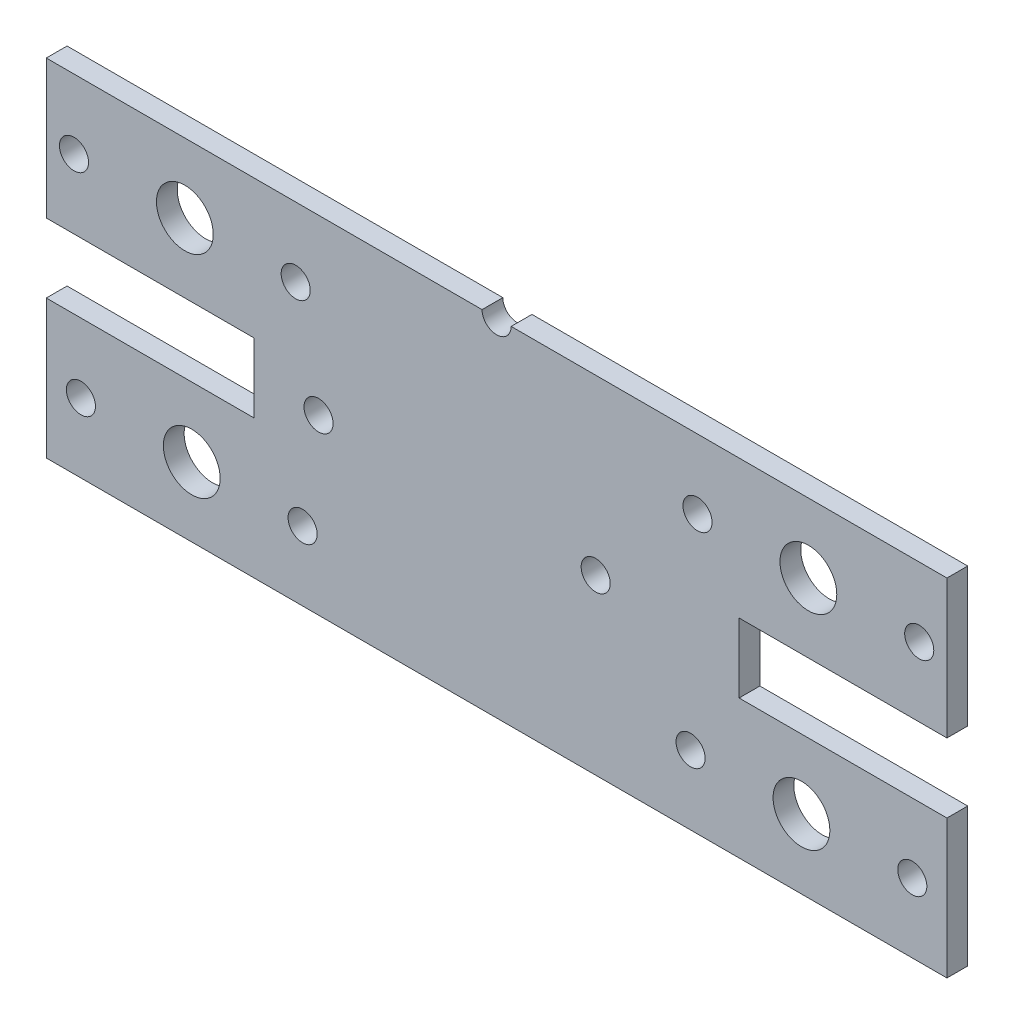
ISO-10303-21;
HEADER;
FILE_DESCRIPTION(('STEP AP214'),'2;1');
FILE_NAME('part.step','',(''),(''),'','','');
FILE_SCHEMA(('AUTOMOTIVE_DESIGN { 1 0 10303 214 1 1 1 1 }'));
ENDSEC;
DATA;
#1=APPLICATION_CONTEXT('core data for automotive mechanical design processes');
#2=APPLICATION_PROTOCOL_DEFINITION('international standard','automotive_design',2000,#1);
#3=PRODUCT_CONTEXT('',#1,'mechanical');
#4=PRODUCT('Part','Part','',(#3));
#5=PRODUCT_RELATED_PRODUCT_CATEGORY('part','',(#4));
#6=PRODUCT_DEFINITION_FORMATION('','',#4);
#7=PRODUCT_DEFINITION_CONTEXT('part definition',#1,'design');
#8=PRODUCT_DEFINITION('design','',#6,#7);
#9=PRODUCT_DEFINITION_SHAPE('','',#8);
#10=(LENGTH_UNIT() NAMED_UNIT(*) SI_UNIT(.MILLI.,.METRE.));
#11=(NAMED_UNIT(*) PLANE_ANGLE_UNIT() SI_UNIT($,.RADIAN.));
#12=(NAMED_UNIT(*) SI_UNIT($,.STERADIAN.) SOLID_ANGLE_UNIT());
#13=UNCERTAINTY_MEASURE_WITH_UNIT(LENGTH_MEASURE(1.E-05),#10,'distance_accuracy_value','');
#14=(GEOMETRIC_REPRESENTATION_CONTEXT(3) GLOBAL_UNCERTAINTY_ASSIGNED_CONTEXT((#13)) GLOBAL_UNIT_ASSIGNED_CONTEXT((#10,
#11,#12)) REPRESENTATION_CONTEXT('',''));
#15=CARTESIAN_POINT('',(0.,0.,0.));
#16=DIRECTION('',(0.,0.,1.));
#17=DIRECTION('',(1.,0.,0.));
#18=AXIS2_PLACEMENT_3D('',#15,#16,#17);
#19=CARTESIAN_POINT('',(0.,0.,3.));
#20=DIRECTION('',(1.,0.,0.));
#21=DIRECTION('',(0.,0.,-1.));
#22=AXIS2_PLACEMENT_3D('',#19,#20,#21);
#23=PLANE('',#22);
#24=DIRECTION('',(0.,-1.,0.));
#25=VECTOR('',#24,1.);
#26=CARTESIAN_POINT('',(0.,0.,3.));
#27=LINE('',#26,#25);
#28=CARTESIAN_POINT('',(0.,20.,3.));
#29=VERTEX_POINT('',#28);
#30=CARTESIAN_POINT('',(0.,0.,3.));
#31=VERTEX_POINT('',#30);
#32=EDGE_CURVE('E175',#29,#31,#27,.T.);
#33=ORIENTED_EDGE('',*,*,#32,.F.);
#34=DIRECTION('',(0.,0.,-1.));
#35=VECTOR('',#34,1.);
#36=CARTESIAN_POINT('',(0.,20.,3.001));
#37=LINE('',#36,#35);
#38=CARTESIAN_POINT('',(0.,20.,0.));
#39=VERTEX_POINT('',#38);
#40=EDGE_CURVE('E342',#29,#39,#37,.T.);
#41=ORIENTED_EDGE('',*,*,#40,.T.);
#42=DIRECTION('',(0.,-1.,0.));
#43=VECTOR('',#42,1.);
#44=CARTESIAN_POINT('',(0.,0.,0.));
#45=LINE('',#44,#43);
#46=CARTESIAN_POINT('',(0.,0.,0.));
#47=VERTEX_POINT('',#46);
#48=EDGE_CURVE('E159',#39,#47,#45,.T.);
#49=ORIENTED_EDGE('',*,*,#48,.T.);
#50=DIRECTION('',(0.,0.,-1.));
#51=VECTOR('',#50,1.);
#52=CARTESIAN_POINT('',(0.,0.,3.));
#53=LINE('',#52,#51);
#54=EDGE_CURVE('E11',#31,#47,#53,.T.);
#55=ORIENTED_EDGE('',*,*,#54,.F.);
#56=EDGE_LOOP('',(#33,#41,#49,#55));
#57=FACE_BOUND('',#56,.T.);
#58=ADVANCED_FACE('F33',(#57),#23,.F.);
#59=CARTESIAN_POINT('',(130.,0.,3.));
#60=DIRECTION('',(-1.,0.,0.));
#61=DIRECTION('',(0.,0.,1.));
#62=AXIS2_PLACEMENT_3D('',#59,#60,#61);
#63=PLANE('',#62);
#64=DIRECTION('',(0.,1.,0.));
#65=VECTOR('',#64,1.);
#66=CARTESIAN_POINT('',(130.,0.,3.));
#67=LINE('',#66,#65);
#68=CARTESIAN_POINT('',(130.,30.,3.));
#69=VERTEX_POINT('',#68);
#70=CARTESIAN_POINT('',(130.,50.,3.));
#71=VERTEX_POINT('',#70);
#72=EDGE_CURVE('E314',#69,#71,#67,.T.);
#73=ORIENTED_EDGE('',*,*,#72,.F.);
#74=DIRECTION('',(0.,0.,-1.));
#75=VECTOR('',#74,1.);
#76=CARTESIAN_POINT('',(130.,30.,3.001));
#77=LINE('',#76,#75);
#78=CARTESIAN_POINT('',(130.,30.,0.));
#79=VERTEX_POINT('',#78);
#80=EDGE_CURVE('E209',#69,#79,#77,.T.);
#81=ORIENTED_EDGE('',*,*,#80,.T.);
#82=DIRECTION('',(0.,1.,0.));
#83=VECTOR('',#82,1.);
#84=CARTESIAN_POINT('',(130.,0.,0.));
#85=LINE('',#84,#83);
#86=CARTESIAN_POINT('',(130.,50.,0.));
#87=VERTEX_POINT('',#86);
#88=EDGE_CURVE('E161',#79,#87,#85,.T.);
#89=ORIENTED_EDGE('',*,*,#88,.T.);
#90=DIRECTION('',(0.,0.,-1.));
#91=VECTOR('',#90,1.);
#92=CARTESIAN_POINT('',(130.,50.,3.));
#93=LINE('',#92,#91);
#94=EDGE_CURVE('E177',#71,#87,#93,.T.);
#95=ORIENTED_EDGE('',*,*,#94,.F.);
#96=EDGE_LOOP('',(#73,#81,#89,#95));
#97=FACE_BOUND('',#96,.T.);
#98=ADVANCED_FACE('F328',(#97),#63,.F.);
#99=CARTESIAN_POINT('',(0.,50.,3.));
#100=DIRECTION('',(0.,-1.,0.));
#101=DIRECTION('',(0.,0.,-1.));
#102=AXIS2_PLACEMENT_3D('',#99,#100,#101);
#103=PLANE('',#102);
#104=DIRECTION('',(-1.,0.,0.));
#105=VECTOR('',#104,1.);
#106=CARTESIAN_POINT('',(0.,50.,3.));
#107=LINE('',#106,#105);
#108=CARTESIAN_POINT('',(62.9,50.,3.));
#109=VERTEX_POINT('',#108);
#110=CARTESIAN_POINT('',(0.,50.,3.));
#111=VERTEX_POINT('',#110);
#112=EDGE_CURVE('E315',#109,#111,#107,.T.);
#113=ORIENTED_EDGE('',*,*,#112,.F.);
#114=DIRECTION('',(0.,0.,-1.));
#115=VECTOR('',#114,1.);
#116=CARTESIAN_POINT('',(62.9,50.,3.001));
#117=LINE('',#116,#115);
#118=CARTESIAN_POINT('',(62.9,50.,0.));
#119=VERTEX_POINT('',#118);
#120=EDGE_CURVE('E223',#109,#119,#117,.T.);
#121=ORIENTED_EDGE('',*,*,#120,.T.);
#122=DIRECTION('',(-1.,0.,0.));
#123=VECTOR('',#122,1.);
#124=CARTESIAN_POINT('',(0.,50.,0.));
#125=LINE('',#124,#123);
#126=CARTESIAN_POINT('',(0.,50.,0.));
#127=VERTEX_POINT('',#126);
#128=EDGE_CURVE('E171',#119,#127,#125,.T.);
#129=ORIENTED_EDGE('',*,*,#128,.T.);
#130=DIRECTION('',(0.,0.,-1.));
#131=VECTOR('',#130,1.);
#132=CARTESIAN_POINT('',(0.,50.,3.));
#133=LINE('',#132,#131);
#134=EDGE_CURVE('E157',#111,#127,#133,.T.);
#135=ORIENTED_EDGE('',*,*,#134,.F.);
#136=EDGE_LOOP('',(#113,#121,#129,#135));
#137=FACE_BOUND('',#136,.T.);
#138=ADVANCED_FACE('F339',(#137),#103,.F.);
#139=CARTESIAN_POINT('',(0.,0.,3.));
#140=DIRECTION('',(0.,0.,-1.));
#141=DIRECTION('',(-1.,0.,0.));
#142=AXIS2_PLACEMENT_3D('',#139,#140,#141);
#143=PLANE('',#142);
#144=DIRECTION('',(0.,1.,0.));
#145=VECTOR('',#144,1.);
#146=CARTESIAN_POINT('',(30.,20.,3.));
#147=LINE('',#146,#145);
#148=CARTESIAN_POINT('',(30.,20.,3.));
#149=VERTEX_POINT('',#148);
#150=CARTESIAN_POINT('',(30.,30.,3.));
#151=VERTEX_POINT('',#150);
#152=EDGE_CURVE('E218',#149,#151,#147,.T.);
#153=ORIENTED_EDGE('',*,*,#152,.F.);
#154=DIRECTION('',(1.,0.,0.));
#155=VECTOR('',#154,1.);
#156=CARTESIAN_POINT('',(0.,20.,3.));
#157=LINE('',#156,#155);
#158=EDGE_CURVE('E153',#29,#149,#157,.T.);
#159=ORIENTED_EDGE('',*,*,#158,.F.);
#160=ORIENTED_EDGE('',*,*,#32,.T.);
#161=DIRECTION('',(1.,0.,0.));
#162=VECTOR('',#161,1.);
#163=CARTESIAN_POINT('',(0.,0.,3.));
#164=LINE('',#163,#162);
#165=CARTESIAN_POINT('',(130.,0.,3.));
#166=VERTEX_POINT('',#165);
#167=EDGE_CURVE('E313',#31,#166,#164,.T.);
#168=ORIENTED_EDGE('',*,*,#167,.T.);
#169=CARTESIAN_POINT('',(130.,20.,3.));
#170=VERTEX_POINT('',#169);
#171=EDGE_CURVE('E186',#166,#170,#67,.T.);
#172=ORIENTED_EDGE('',*,*,#171,.T.);
#173=DIRECTION('',(1.,0.,0.));
#174=VECTOR('',#173,1.);
#175=CARTESIAN_POINT('',(130.,20.,3.));
#176=LINE('',#175,#174);
#177=CARTESIAN_POINT('',(100.,20.,3.));
#178=VERTEX_POINT('',#177);
#179=EDGE_CURVE('E56',#178,#170,#176,.T.);
#180=ORIENTED_EDGE('',*,*,#179,.F.);
#181=DIRECTION('',(0.,-1.,0.));
#182=VECTOR('',#181,1.);
#183=CARTESIAN_POINT('',(100.,20.,3.));
#184=LINE('',#183,#182);
#185=CARTESIAN_POINT('',(100.,30.,3.));
#186=VERTEX_POINT('',#185);
#187=EDGE_CURVE('E203',#186,#178,#184,.T.);
#188=ORIENTED_EDGE('',*,*,#187,.F.);
#189=DIRECTION('',(-1.,0.,0.));
#190=VECTOR('',#189,1.);
#191=CARTESIAN_POINT('',(130.,30.,3.));
#192=LINE('',#191,#190);
#193=EDGE_CURVE('E198',#69,#186,#192,.T.);
#194=ORIENTED_EDGE('',*,*,#193,.F.);
#195=ORIENTED_EDGE('',*,*,#72,.T.);
#196=CARTESIAN_POINT('',(67.1,50.,3.));
#197=VERTEX_POINT('',#196);
#198=EDGE_CURVE('E165',#71,#197,#107,.T.);
#199=ORIENTED_EDGE('',*,*,#198,.T.);
#200=CARTESIAN_POINT('',(65.,50.,3.));
#201=DIRECTION('',(0.,0.,-1.));
#202=DIRECTION('',(-1.,0.,0.));
#203=AXIS2_PLACEMENT_3D('',#200,#201,#202);
#204=CIRCLE('',#203,2.1);
#205=EDGE_CURVE('E219',#109,#197,#204,.F.);
#206=ORIENTED_EDGE('',*,*,#205,.F.);
#207=ORIENTED_EDGE('',*,*,#112,.T.);
#208=CARTESIAN_POINT('',(0.,30.,3.));
#209=VERTEX_POINT('',#208);
#210=EDGE_CURVE('E311',#111,#209,#27,.T.);
#211=ORIENTED_EDGE('',*,*,#210,.T.);
#212=DIRECTION('',(-1.,0.,0.));
#213=VECTOR('',#212,1.);
#214=CARTESIAN_POINT('',(0.,30.,3.));
#215=LINE('',#214,#213);
#216=EDGE_CURVE('E48',#151,#209,#215,.T.);
#217=ORIENTED_EDGE('',*,*,#216,.F.);
#218=EDGE_LOOP('',(#153,#159,#160,#168,#172,#180,#188,#194,#195,#199,#206,#207,#211,#217));
#219=FACE_BOUND('',#218,.T.);
#220=CARTESIAN_POINT('',(39.3,25.,3.));
#221=DIRECTION('',(0.,0.,1.));
#222=DIRECTION('',(1.,0.,0.));
#223=AXIS2_PLACEMENT_3D('',#220,#221,#222);
#224=CIRCLE('',#223,2.1);
#225=CARTESIAN_POINT('',(41.4,25.,3.));
#226=VERTEX_POINT('',#225);
#227=EDGE_CURVE('E163',#226,#226,#224,.T.);
#228=ORIENTED_EDGE('',*,*,#227,.F.);
#229=EDGE_LOOP('',(#228));
#230=FACE_BOUND('',#229,.T.);
#231=CARTESIAN_POINT('',(79.3,25.,3.));
#232=DIRECTION('',(0.,0.,1.));
#233=DIRECTION('',(1.,0.,0.));
#234=AXIS2_PLACEMENT_3D('',#231,#232,#233);
#235=CIRCLE('',#234,2.1);
#236=CARTESIAN_POINT('',(81.4,25.,3.));
#237=VERTEX_POINT('',#236);
#238=EDGE_CURVE('E301',#237,#237,#235,.T.);
#239=ORIENTED_EDGE('',*,*,#238,.F.);
#240=EDGE_LOOP('',(#239));
#241=FACE_BOUND('',#240,.T.);
#242=CARTESIAN_POINT('',(4.,40.,3.));
#243=DIRECTION('',(0.,0.,1.));
#244=DIRECTION('',(1.,0.,0.));
#245=AXIS2_PLACEMENT_3D('',#242,#243,#244);
#246=CIRCLE('',#245,2.1);
#247=CARTESIAN_POINT('',(6.1,40.,3.));
#248=VERTEX_POINT('',#247);
#249=EDGE_CURVE('E295',#248,#248,#246,.T.);
#250=ORIENTED_EDGE('',*,*,#249,.F.);
#251=EDGE_LOOP('',(#250));
#252=FACE_BOUND('',#251,.T.);
#253=CARTESIAN_POINT('',(20.,40.,3.));
#254=DIRECTION('',(0.,0.,1.));
#255=DIRECTION('',(1.,0.,0.));
#256=AXIS2_PLACEMENT_3D('',#253,#254,#255);
#257=CIRCLE('',#256,4.10000000000001);
#258=CARTESIAN_POINT('',(24.1,40.,3.));
#259=VERTEX_POINT('',#258);
#260=EDGE_CURVE('E289',#259,#259,#257,.T.);
#261=ORIENTED_EDGE('',*,*,#260,.F.);
#262=EDGE_LOOP('',(#261));
#263=FACE_BOUND('',#262,.T.);
#264=CARTESIAN_POINT('',(36.,40.,3.));
#265=DIRECTION('',(0.,0.,1.));
#266=DIRECTION('',(1.,0.,0.));
#267=AXIS2_PLACEMENT_3D('',#264,#265,#266);
#268=CIRCLE('',#267,2.1);
#269=CARTESIAN_POINT('',(38.1,40.,3.));
#270=VERTEX_POINT('',#269);
#271=EDGE_CURVE('E283',#270,#270,#268,.T.);
#272=ORIENTED_EDGE('',*,*,#271,.F.);
#273=EDGE_LOOP('',(#272));
#274=FACE_BOUND('',#273,.T.);
#275=CARTESIAN_POINT('',(94.,40.,3.));
#276=DIRECTION('',(0.,0.,1.));
#277=DIRECTION('',(1.,0.,0.));
#278=AXIS2_PLACEMENT_3D('',#275,#276,#277);
#279=CIRCLE('',#278,2.1);
#280=CARTESIAN_POINT('',(96.1,40.,3.));
#281=VERTEX_POINT('',#280);
#282=EDGE_CURVE('E277',#281,#281,#279,.T.);
#283=ORIENTED_EDGE('',*,*,#282,.F.);
#284=EDGE_LOOP('',(#283));
#285=FACE_BOUND('',#284,.T.);
#286=CARTESIAN_POINT('',(110.,40.,3.));
#287=DIRECTION('',(0.,0.,1.));
#288=DIRECTION('',(1.,0.,0.));
#289=AXIS2_PLACEMENT_3D('',#286,#287,#288);
#290=CIRCLE('',#289,4.1);
#291=CARTESIAN_POINT('',(114.1,40.,3.));
#292=VERTEX_POINT('',#291);
#293=EDGE_CURVE('E271',#292,#292,#290,.T.);
#294=ORIENTED_EDGE('',*,*,#293,.F.);
#295=EDGE_LOOP('',(#294));
#296=FACE_BOUND('',#295,.T.);
#297=CARTESIAN_POINT('',(126.,40.,3.));
#298=DIRECTION('',(0.,0.,1.));
#299=DIRECTION('',(1.,0.,0.));
#300=AXIS2_PLACEMENT_3D('',#297,#298,#299);
#301=CIRCLE('',#300,2.09999999999999);
#302=CARTESIAN_POINT('',(128.1,40.,3.));
#303=VERTEX_POINT('',#302);
#304=EDGE_CURVE('E265',#303,#303,#301,.T.);
#305=ORIENTED_EDGE('',*,*,#304,.F.);
#306=EDGE_LOOP('',(#305));
#307=FACE_BOUND('',#306,.T.);
#308=CARTESIAN_POINT('',(5.,9.99999999999998,3.));
#309=DIRECTION('',(0.,0.,1.));
#310=DIRECTION('',(1.,0.,0.));
#311=AXIS2_PLACEMENT_3D('',#308,#309,#310);
#312=CIRCLE('',#311,2.1);
#313=CARTESIAN_POINT('',(7.1,9.99999999999998,3.));
#314=VERTEX_POINT('',#313);
#315=EDGE_CURVE('E259',#314,#314,#312,.T.);
#316=ORIENTED_EDGE('',*,*,#315,.F.);
#317=EDGE_LOOP('',(#316));
#318=FACE_BOUND('',#317,.T.);
#319=CARTESIAN_POINT('',(21.,9.99999999999998,3.));
#320=DIRECTION('',(0.,0.,1.));
#321=DIRECTION('',(1.,0.,0.));
#322=AXIS2_PLACEMENT_3D('',#319,#320,#321);
#323=CIRCLE('',#322,4.1);
#324=CARTESIAN_POINT('',(25.1,9.99999999999998,3.));
#325=VERTEX_POINT('',#324);
#326=EDGE_CURVE('E253',#325,#325,#323,.T.);
#327=ORIENTED_EDGE('',*,*,#326,.F.);
#328=EDGE_LOOP('',(#327));
#329=FACE_BOUND('',#328,.T.);
#330=CARTESIAN_POINT('',(37.,9.99999999999999,3.));
#331=DIRECTION('',(0.,0.,1.));
#332=DIRECTION('',(1.,0.,0.));
#333=AXIS2_PLACEMENT_3D('',#330,#331,#332);
#334=CIRCLE('',#333,2.1);
#335=CARTESIAN_POINT('',(39.1,9.99999999999999,3.));
#336=VERTEX_POINT('',#335);
#337=EDGE_CURVE('E247',#336,#336,#334,.T.);
#338=ORIENTED_EDGE('',*,*,#337,.F.);
#339=EDGE_LOOP('',(#338));
#340=FACE_BOUND('',#339,.T.);
#341=CARTESIAN_POINT('',(93.,10.,3.));
#342=DIRECTION('',(0.,0.,1.));
#343=DIRECTION('',(1.,0.,0.));
#344=AXIS2_PLACEMENT_3D('',#341,#342,#343);
#345=CIRCLE('',#344,2.1);
#346=CARTESIAN_POINT('',(95.1,10.,3.));
#347=VERTEX_POINT('',#346);
#348=EDGE_CURVE('E241',#347,#347,#345,.T.);
#349=ORIENTED_EDGE('',*,*,#348,.F.);
#350=EDGE_LOOP('',(#349));
#351=FACE_BOUND('',#350,.T.);
#352=CARTESIAN_POINT('',(109.,10.,3.));
#353=DIRECTION('',(0.,0.,1.));
#354=DIRECTION('',(1.,0.,0.));
#355=AXIS2_PLACEMENT_3D('',#352,#353,#354);
#356=CIRCLE('',#355,4.1);
#357=CARTESIAN_POINT('',(113.1,10.,3.));
#358=VERTEX_POINT('',#357);
#359=EDGE_CURVE('E235',#358,#358,#356,.T.);
#360=ORIENTED_EDGE('',*,*,#359,.F.);
#361=EDGE_LOOP('',(#360));
#362=FACE_BOUND('',#361,.T.);
#363=CARTESIAN_POINT('',(125.,10.,3.));
#364=DIRECTION('',(0.,0.,1.));
#365=DIRECTION('',(1.,0.,0.));
#366=AXIS2_PLACEMENT_3D('',#363,#364,#365);
#367=CIRCLE('',#366,2.09999999999999);
#368=CARTESIAN_POINT('',(127.1,10.,3.));
#369=VERTEX_POINT('',#368);
#370=EDGE_CURVE('E228',#369,#369,#367,.T.);
#371=ORIENTED_EDGE('',*,*,#370,.F.);
#372=EDGE_LOOP('',(#371));
#373=FACE_BOUND('',#372,.T.);
#374=ADVANCED_FACE('F322',(#219,#230,#241,#252,#263,#274,#285,#296,#307,#318,#329,#340,#351,
#362,#373),#143,.F.);
#375=CARTESIAN_POINT('',(0.,0.,0.));
#376=DIRECTION('',(0.,0.,-1.));
#377=DIRECTION('',(-1.,0.,0.));
#378=AXIS2_PLACEMENT_3D('',#375,#376,#377);
#379=PLANE('',#378);
#380=DIRECTION('',(-1.,0.,0.));
#381=VECTOR('',#380,1.);
#382=CARTESIAN_POINT('',(0.,20.,0.));
#383=LINE('',#382,#381);
#384=CARTESIAN_POINT('',(30.,20.,0.));
#385=VERTEX_POINT('',#384);
#386=EDGE_CURVE('E142',#385,#39,#383,.T.);
#387=ORIENTED_EDGE('',*,*,#386,.F.);
#388=DIRECTION('',(0.,-1.,0.));
#389=VECTOR('',#388,1.);
#390=CARTESIAN_POINT('',(30.,20.,0.));
#391=LINE('',#390,#389);
#392=CARTESIAN_POINT('',(30.,30.,0.));
#393=VERTEX_POINT('',#392);
#394=EDGE_CURVE('E152',#393,#385,#391,.T.);
#395=ORIENTED_EDGE('',*,*,#394,.F.);
#396=DIRECTION('',(1.,0.,0.));
#397=VECTOR('',#396,1.);
#398=CARTESIAN_POINT('',(0.,30.,0.));
#399=LINE('',#398,#397);
#400=CARTESIAN_POINT('',(0.,30.,0.));
#401=VERTEX_POINT('',#400);
#402=EDGE_CURVE('E135',#401,#393,#399,.T.);
#403=ORIENTED_EDGE('',*,*,#402,.F.);
#404=EDGE_CURVE('E150',#127,#401,#45,.T.);
#405=ORIENTED_EDGE('',*,*,#404,.F.);
#406=ORIENTED_EDGE('',*,*,#128,.F.);
#407=CARTESIAN_POINT('',(65.,50.,0.));
#408=DIRECTION('',(0.,0.,-1.));
#409=DIRECTION('',(-1.,0.,0.));
#410=AXIS2_PLACEMENT_3D('',#407,#408,#409);
#411=CIRCLE('',#410,2.1);
#412=CARTESIAN_POINT('',(67.1,50.,0.));
#413=VERTEX_POINT('',#412);
#414=EDGE_CURVE('E221',#413,#119,#411,.T.);
#415=ORIENTED_EDGE('',*,*,#414,.F.);
#416=EDGE_CURVE('E172',#87,#413,#125,.T.);
#417=ORIENTED_EDGE('',*,*,#416,.F.);
#418=ORIENTED_EDGE('',*,*,#88,.F.);
#419=DIRECTION('',(1.,0.,0.));
#420=VECTOR('',#419,1.);
#421=CARTESIAN_POINT('',(130.,30.,0.));
#422=LINE('',#421,#420);
#423=CARTESIAN_POINT('',(100.,30.,0.));
#424=VERTEX_POINT('',#423);
#425=EDGE_CURVE('E200',#424,#79,#422,.T.);
#426=ORIENTED_EDGE('',*,*,#425,.F.);
#427=DIRECTION('',(0.,1.,0.));
#428=VECTOR('',#427,1.);
#429=CARTESIAN_POINT('',(100.,20.,0.));
#430=LINE('',#429,#428);
#431=CARTESIAN_POINT('',(100.,20.,0.));
#432=VERTEX_POINT('',#431);
#433=EDGE_CURVE('E197',#432,#424,#430,.T.);
#434=ORIENTED_EDGE('',*,*,#433,.F.);
#435=DIRECTION('',(-1.,0.,0.));
#436=VECTOR('',#435,1.);
#437=CARTESIAN_POINT('',(130.,20.,0.));
#438=LINE('',#437,#436);
#439=CARTESIAN_POINT('',(130.,20.,0.));
#440=VERTEX_POINT('',#439);
#441=EDGE_CURVE('E194',#440,#432,#438,.T.);
#442=ORIENTED_EDGE('',*,*,#441,.F.);
#443=CARTESIAN_POINT('',(130.,0.,0.));
#444=VERTEX_POINT('',#443);
#445=EDGE_CURVE('E168',#444,#440,#85,.T.);
#446=ORIENTED_EDGE('',*,*,#445,.F.);
#447=DIRECTION('',(1.,0.,0.));
#448=VECTOR('',#447,1.);
#449=CARTESIAN_POINT('',(0.,0.,0.));
#450=LINE('',#449,#448);
#451=EDGE_CURVE('E158',#47,#444,#450,.T.);
#452=ORIENTED_EDGE('',*,*,#451,.F.);
#453=ORIENTED_EDGE('',*,*,#48,.F.);
#454=EDGE_LOOP('',(#387,#395,#403,#405,#406,#415,#417,#418,#426,#434,#442,#446,#452,#453));
#455=FACE_BOUND('',#454,.T.);
#456=CARTESIAN_POINT('',(109.,10.,0.));
#457=DIRECTION('',(0.,0.,1.));
#458=DIRECTION('',(1.,0.,0.));
#459=AXIS2_PLACEMENT_3D('',#456,#457,#458);
#460=CIRCLE('',#459,4.1);
#461=CARTESIAN_POINT('',(113.1,10.,0.));
#462=VERTEX_POINT('',#461);
#463=EDGE_CURVE('E231',#462,#462,#460,.T.);
#464=ORIENTED_EDGE('',*,*,#463,.T.);
#465=EDGE_LOOP('',(#464));
#466=FACE_BOUND('',#465,.T.);
#467=CARTESIAN_POINT('',(37.,9.99999999999999,0.));
#468=DIRECTION('',(0.,0.,1.));
#469=DIRECTION('',(1.,0.,0.));
#470=AXIS2_PLACEMENT_3D('',#467,#468,#469);
#471=CIRCLE('',#470,2.1);
#472=CARTESIAN_POINT('',(39.1,9.99999999999999,0.));
#473=VERTEX_POINT('',#472);
#474=EDGE_CURVE('E244',#473,#473,#471,.T.);
#475=ORIENTED_EDGE('',*,*,#474,.T.);
#476=EDGE_LOOP('',(#475));
#477=FACE_BOUND('',#476,.T.);
#478=CARTESIAN_POINT('',(5.,9.99999999999998,0.));
#479=DIRECTION('',(0.,0.,1.));
#480=DIRECTION('',(1.,0.,0.));
#481=AXIS2_PLACEMENT_3D('',#478,#479,#480);
#482=CIRCLE('',#481,2.1);
#483=CARTESIAN_POINT('',(7.1,9.99999999999998,0.));
#484=VERTEX_POINT('',#483);
#485=EDGE_CURVE('E256',#484,#484,#482,.T.);
#486=ORIENTED_EDGE('',*,*,#485,.T.);
#487=EDGE_LOOP('',(#486));
#488=FACE_BOUND('',#487,.T.);
#489=CARTESIAN_POINT('',(110.,40.,0.));
#490=DIRECTION('',(0.,0.,1.));
#491=DIRECTION('',(1.,0.,0.));
#492=AXIS2_PLACEMENT_3D('',#489,#490,#491);
#493=CIRCLE('',#492,4.1);
#494=CARTESIAN_POINT('',(114.1,40.,0.));
#495=VERTEX_POINT('',#494);
#496=EDGE_CURVE('E268',#495,#495,#493,.T.);
#497=ORIENTED_EDGE('',*,*,#496,.T.);
#498=EDGE_LOOP('',(#497));
#499=FACE_BOUND('',#498,.T.);
#500=CARTESIAN_POINT('',(36.,40.,0.));
#501=DIRECTION('',(0.,0.,1.));
#502=DIRECTION('',(1.,0.,0.));
#503=AXIS2_PLACEMENT_3D('',#500,#501,#502);
#504=CIRCLE('',#503,2.1);
#505=CARTESIAN_POINT('',(38.1,40.,0.));
#506=VERTEX_POINT('',#505);
#507=EDGE_CURVE('E280',#506,#506,#504,.T.);
#508=ORIENTED_EDGE('',*,*,#507,.T.);
#509=EDGE_LOOP('',(#508));
#510=FACE_BOUND('',#509,.T.);
#511=CARTESIAN_POINT('',(4.,40.,0.));
#512=DIRECTION('',(0.,0.,1.));
#513=DIRECTION('',(1.,0.,0.));
#514=AXIS2_PLACEMENT_3D('',#511,#512,#513);
#515=CIRCLE('',#514,2.1);
#516=CARTESIAN_POINT('',(6.1,40.,0.));
#517=VERTEX_POINT('',#516);
#518=EDGE_CURVE('E292',#517,#517,#515,.T.);
#519=ORIENTED_EDGE('',*,*,#518,.T.);
#520=EDGE_LOOP('',(#519));
#521=FACE_BOUND('',#520,.T.);
#522=CARTESIAN_POINT('',(39.3,25.,0.));
#523=DIRECTION('',(0.,0.,1.));
#524=DIRECTION('',(1.,0.,0.));
#525=AXIS2_PLACEMENT_3D('',#522,#523,#524);
#526=CIRCLE('',#525,2.1);
#527=CARTESIAN_POINT('',(41.4,25.,0.));
#528=VERTEX_POINT('',#527);
#529=EDGE_CURVE('E304',#528,#528,#526,.T.);
#530=ORIENTED_EDGE('',*,*,#529,.T.);
#531=EDGE_LOOP('',(#530));
#532=FACE_BOUND('',#531,.T.);
#533=CARTESIAN_POINT('',(79.3,25.,0.));
#534=DIRECTION('',(0.,0.,1.));
#535=DIRECTION('',(1.,0.,0.));
#536=AXIS2_PLACEMENT_3D('',#533,#534,#535);
#537=CIRCLE('',#536,2.1);
#538=CARTESIAN_POINT('',(81.4,25.,0.));
#539=VERTEX_POINT('',#538);
#540=EDGE_CURVE('E298',#539,#539,#537,.T.);
#541=ORIENTED_EDGE('',*,*,#540,.T.);
#542=EDGE_LOOP('',(#541));
#543=FACE_BOUND('',#542,.T.);
#544=CARTESIAN_POINT('',(20.,40.,0.));
#545=DIRECTION('',(0.,0.,1.));
#546=DIRECTION('',(1.,0.,0.));
#547=AXIS2_PLACEMENT_3D('',#544,#545,#546);
#548=CIRCLE('',#547,4.10000000000001);
#549=CARTESIAN_POINT('',(24.1,40.,0.));
#550=VERTEX_POINT('',#549);
#551=EDGE_CURVE('E286',#550,#550,#548,.T.);
#552=ORIENTED_EDGE('',*,*,#551,.T.);
#553=EDGE_LOOP('',(#552));
#554=FACE_BOUND('',#553,.T.);
#555=CARTESIAN_POINT('',(94.,40.,0.));
#556=DIRECTION('',(0.,0.,1.));
#557=DIRECTION('',(1.,0.,0.));
#558=AXIS2_PLACEMENT_3D('',#555,#556,#557);
#559=CIRCLE('',#558,2.1);
#560=CARTESIAN_POINT('',(96.1,40.,0.));
#561=VERTEX_POINT('',#560);
#562=EDGE_CURVE('E274',#561,#561,#559,.T.);
#563=ORIENTED_EDGE('',*,*,#562,.T.);
#564=EDGE_LOOP('',(#563));
#565=FACE_BOUND('',#564,.T.);
#566=CARTESIAN_POINT('',(126.,40.,0.));
#567=DIRECTION('',(0.,0.,1.));
#568=DIRECTION('',(1.,0.,0.));
#569=AXIS2_PLACEMENT_3D('',#566,#567,#568);
#570=CIRCLE('',#569,2.09999999999999);
#571=CARTESIAN_POINT('',(128.1,40.,0.));
#572=VERTEX_POINT('',#571);
#573=EDGE_CURVE('E262',#572,#572,#570,.T.);
#574=ORIENTED_EDGE('',*,*,#573,.T.);
#575=EDGE_LOOP('',(#574));
#576=FACE_BOUND('',#575,.T.);
#577=CARTESIAN_POINT('',(21.,9.99999999999998,0.));
#578=DIRECTION('',(0.,0.,1.));
#579=DIRECTION('',(1.,0.,0.));
#580=AXIS2_PLACEMENT_3D('',#577,#578,#579);
#581=CIRCLE('',#580,4.1);
#582=CARTESIAN_POINT('',(25.1,9.99999999999998,0.));
#583=VERTEX_POINT('',#582);
#584=EDGE_CURVE('E250',#583,#583,#581,.T.);
#585=ORIENTED_EDGE('',*,*,#584,.T.);
#586=EDGE_LOOP('',(#585));
#587=FACE_BOUND('',#586,.T.);
#588=CARTESIAN_POINT('',(93.,10.,0.));
#589=DIRECTION('',(0.,0.,1.));
#590=DIRECTION('',(1.,0.,0.));
#591=AXIS2_PLACEMENT_3D('',#588,#589,#590);
#592=CIRCLE('',#591,2.1);
#593=CARTESIAN_POINT('',(95.1,10.,0.));
#594=VERTEX_POINT('',#593);
#595=EDGE_CURVE('E238',#594,#594,#592,.T.);
#596=ORIENTED_EDGE('',*,*,#595,.T.);
#597=EDGE_LOOP('',(#596));
#598=FACE_BOUND('',#597,.T.);
#599=CARTESIAN_POINT('',(125.,10.,0.));
#600=DIRECTION('',(0.,0.,1.));
#601=DIRECTION('',(1.,0.,0.));
#602=AXIS2_PLACEMENT_3D('',#599,#600,#601);
#603=CIRCLE('',#602,2.09999999999999);
#604=CARTESIAN_POINT('',(127.1,10.,0.));
#605=VERTEX_POINT('',#604);
#606=EDGE_CURVE('E232',#605,#605,#603,.T.);
#607=ORIENTED_EDGE('',*,*,#606,.T.);
#608=EDGE_LOOP('',(#607));
#609=FACE_BOUND('',#608,.T.);
#610=ADVANCED_FACE('F147',(#455,#466,#477,#488,#499,#510,#521,#532,#543,#554,#565,#576,#587,
#598,#609),#379,.T.);
#611=ORIENTED_EDGE('',*,*,#404,.T.);
#612=DIRECTION('',(0.,0.,-1.));
#613=VECTOR('',#612,1.);
#614=CARTESIAN_POINT('',(0.,30.,3.001));
#615=LINE('',#614,#613);
#616=EDGE_CURVE('E132',#209,#401,#615,.T.);
#617=ORIENTED_EDGE('',*,*,#616,.F.);
#618=ORIENTED_EDGE('',*,*,#210,.F.);
#619=ORIENTED_EDGE('',*,*,#134,.T.);
#620=EDGE_LOOP('',(#611,#617,#618,#619));
#621=FACE_BOUND('',#620,.T.);
#622=ADVANCED_FACE('F35',(#621),#23,.F.);
#623=CARTESIAN_POINT('',(0.,0.,3.));
#624=DIRECTION('',(0.,1.,0.));
#625=DIRECTION('',(0.,0.,1.));
#626=AXIS2_PLACEMENT_3D('',#623,#624,#625);
#627=PLANE('',#626);
#628=ORIENTED_EDGE('',*,*,#451,.T.);
#629=DIRECTION('',(0.,0.,-1.));
#630=VECTOR('',#629,1.);
#631=CARTESIAN_POINT('',(130.,0.,3.));
#632=LINE('',#631,#630);
#633=EDGE_CURVE('E41',#166,#444,#632,.T.);
#634=ORIENTED_EDGE('',*,*,#633,.F.);
#635=ORIENTED_EDGE('',*,*,#167,.F.);
#636=ORIENTED_EDGE('',*,*,#54,.T.);
#637=EDGE_LOOP('',(#628,#634,#635,#636));
#638=FACE_BOUND('',#637,.T.);
#639=ADVANCED_FACE('F372',(#638),#627,.F.);
#640=ORIENTED_EDGE('',*,*,#445,.T.);
#641=DIRECTION('',(0.,0.,-1.));
#642=VECTOR('',#641,1.);
#643=CARTESIAN_POINT('',(130.,20.,3.001));
#644=LINE('',#643,#642);
#645=EDGE_CURVE('E208',#170,#440,#644,.T.);
#646=ORIENTED_EDGE('',*,*,#645,.F.);
#647=ORIENTED_EDGE('',*,*,#171,.F.);
#648=ORIENTED_EDGE('',*,*,#633,.T.);
#649=EDGE_LOOP('',(#640,#646,#647,#648));
#650=FACE_BOUND('',#649,.T.);
#651=ADVANCED_FACE('F184',(#650),#63,.F.);
#652=ORIENTED_EDGE('',*,*,#416,.T.);
#653=DIRECTION('',(0.,0.,-1.));
#654=VECTOR('',#653,1.);
#655=CARTESIAN_POINT('',(67.1,50.,3.001));
#656=LINE('',#655,#654);
#657=EDGE_CURVE('E224',#197,#413,#656,.T.);
#658=ORIENTED_EDGE('',*,*,#657,.F.);
#659=ORIENTED_EDGE('',*,*,#198,.F.);
#660=ORIENTED_EDGE('',*,*,#94,.T.);
#661=EDGE_LOOP('',(#652,#658,#659,#660));
#662=FACE_BOUND('',#661,.T.);
#663=ADVANCED_FACE('F333',(#662),#103,.F.);
#664=CARTESIAN_POINT('',(39.3,25.,3.));
#665=DIRECTION('',(0.,0.,-1.));
#666=DIRECTION('',(-1.,0.,0.));
#667=AXIS2_PLACEMENT_3D('',#664,#665,#666);
#668=CYLINDRICAL_SURFACE('',#667,2.1);
#669=ORIENTED_EDGE('',*,*,#227,.T.);
#670=EDGE_LOOP('',(#669));
#671=FACE_BOUND('',#670,.T.);
#672=ORIENTED_EDGE('',*,*,#529,.F.);
#673=EDGE_LOOP('',(#672));
#674=FACE_BOUND('',#673,.T.);
#675=ADVANCED_FACE('F385',(#671,#674),#668,.F.);
#676=CARTESIAN_POINT('',(79.3,25.,3.));
#677=DIRECTION('',(0.,0.,-1.));
#678=DIRECTION('',(-1.,0.,0.));
#679=AXIS2_PLACEMENT_3D('',#676,#677,#678);
#680=CYLINDRICAL_SURFACE('',#679,2.1);
#681=ORIENTED_EDGE('',*,*,#238,.T.);
#682=EDGE_LOOP('',(#681));
#683=FACE_BOUND('',#682,.T.);
#684=ORIENTED_EDGE('',*,*,#540,.F.);
#685=EDGE_LOOP('',(#684));
#686=FACE_BOUND('',#685,.T.);
#687=ADVANCED_FACE('F402',(#683,#686),#680,.F.);
#688=CARTESIAN_POINT('',(4.,40.,3.));
#689=DIRECTION('',(0.,0.,-1.));
#690=DIRECTION('',(-1.,0.,0.));
#691=AXIS2_PLACEMENT_3D('',#688,#689,#690);
#692=CYLINDRICAL_SURFACE('',#691,2.1);
#693=ORIENTED_EDGE('',*,*,#249,.T.);
#694=EDGE_LOOP('',(#693));
#695=FACE_BOUND('',#694,.T.);
#696=ORIENTED_EDGE('',*,*,#518,.F.);
#697=EDGE_LOOP('',(#696));
#698=FACE_BOUND('',#697,.T.);
#699=ADVANCED_FACE('F409',(#695,#698),#692,.F.);
#700=CARTESIAN_POINT('',(20.,40.,3.));
#701=DIRECTION('',(0.,0.,-1.));
#702=DIRECTION('',(-1.,0.,0.));
#703=AXIS2_PLACEMENT_3D('',#700,#701,#702);
#704=CYLINDRICAL_SURFACE('',#703,4.10000000000001);
#705=ORIENTED_EDGE('',*,*,#260,.T.);
#706=EDGE_LOOP('',(#705));
#707=FACE_BOUND('',#706,.T.);
#708=ORIENTED_EDGE('',*,*,#551,.F.);
#709=EDGE_LOOP('',(#708));
#710=FACE_BOUND('',#709,.T.);
#711=ADVANCED_FACE('F417',(#707,#710),#704,.F.);
#712=CARTESIAN_POINT('',(36.,40.,3.));
#713=DIRECTION('',(0.,0.,-1.));
#714=DIRECTION('',(-1.,0.,0.));
#715=AXIS2_PLACEMENT_3D('',#712,#713,#714);
#716=CYLINDRICAL_SURFACE('',#715,2.1);
#717=ORIENTED_EDGE('',*,*,#271,.T.);
#718=EDGE_LOOP('',(#717));
#719=FACE_BOUND('',#718,.T.);
#720=ORIENTED_EDGE('',*,*,#507,.F.);
#721=EDGE_LOOP('',(#720));
#722=FACE_BOUND('',#721,.T.);
#723=ADVANCED_FACE('F425',(#719,#722),#716,.F.);
#724=CARTESIAN_POINT('',(94.,40.,3.));
#725=DIRECTION('',(0.,0.,-1.));
#726=DIRECTION('',(-1.,0.,0.));
#727=AXIS2_PLACEMENT_3D('',#724,#725,#726);
#728=CYLINDRICAL_SURFACE('',#727,2.1);
#729=ORIENTED_EDGE('',*,*,#282,.T.);
#730=EDGE_LOOP('',(#729));
#731=FACE_BOUND('',#730,.T.);
#732=ORIENTED_EDGE('',*,*,#562,.F.);
#733=EDGE_LOOP('',(#732));
#734=FACE_BOUND('',#733,.T.);
#735=ADVANCED_FACE('F433',(#731,#734),#728,.F.);
#736=CARTESIAN_POINT('',(110.,40.,3.));
#737=DIRECTION('',(0.,0.,-1.));
#738=DIRECTION('',(-1.,0.,0.));
#739=AXIS2_PLACEMENT_3D('',#736,#737,#738);
#740=CYLINDRICAL_SURFACE('',#739,4.1);
#741=ORIENTED_EDGE('',*,*,#293,.T.);
#742=EDGE_LOOP('',(#741));
#743=FACE_BOUND('',#742,.T.);
#744=ORIENTED_EDGE('',*,*,#496,.F.);
#745=EDGE_LOOP('',(#744));
#746=FACE_BOUND('',#745,.T.);
#747=ADVANCED_FACE('F441',(#743,#746),#740,.F.);
#748=CARTESIAN_POINT('',(126.,40.,3.));
#749=DIRECTION('',(0.,0.,-1.));
#750=DIRECTION('',(-1.,0.,0.));
#751=AXIS2_PLACEMENT_3D('',#748,#749,#750);
#752=CYLINDRICAL_SURFACE('',#751,2.09999999999999);
#753=ORIENTED_EDGE('',*,*,#304,.T.);
#754=EDGE_LOOP('',(#753));
#755=FACE_BOUND('',#754,.T.);
#756=ORIENTED_EDGE('',*,*,#573,.F.);
#757=EDGE_LOOP('',(#756));
#758=FACE_BOUND('',#757,.T.);
#759=ADVANCED_FACE('F449',(#755,#758),#752,.F.);
#760=CARTESIAN_POINT('',(5.,9.99999999999998,3.));
#761=DIRECTION('',(0.,0.,-1.));
#762=DIRECTION('',(-1.,0.,0.));
#763=AXIS2_PLACEMENT_3D('',#760,#761,#762);
#764=CYLINDRICAL_SURFACE('',#763,2.1);
#765=ORIENTED_EDGE('',*,*,#315,.T.);
#766=EDGE_LOOP('',(#765));
#767=FACE_BOUND('',#766,.T.);
#768=ORIENTED_EDGE('',*,*,#485,.F.);
#769=EDGE_LOOP('',(#768));
#770=FACE_BOUND('',#769,.T.);
#771=ADVANCED_FACE('F457',(#767,#770),#764,.F.);
#772=CARTESIAN_POINT('',(21.,9.99999999999998,3.));
#773=DIRECTION('',(0.,0.,-1.));
#774=DIRECTION('',(-1.,0.,0.));
#775=AXIS2_PLACEMENT_3D('',#772,#773,#774);
#776=CYLINDRICAL_SURFACE('',#775,4.1);
#777=ORIENTED_EDGE('',*,*,#326,.T.);
#778=EDGE_LOOP('',(#777));
#779=FACE_BOUND('',#778,.T.);
#780=ORIENTED_EDGE('',*,*,#584,.F.);
#781=EDGE_LOOP('',(#780));
#782=FACE_BOUND('',#781,.T.);
#783=ADVANCED_FACE('F465',(#779,#782),#776,.F.);
#784=CARTESIAN_POINT('',(37.,9.99999999999999,3.));
#785=DIRECTION('',(0.,0.,-1.));
#786=DIRECTION('',(-1.,0.,0.));
#787=AXIS2_PLACEMENT_3D('',#784,#785,#786);
#788=CYLINDRICAL_SURFACE('',#787,2.1);
#789=ORIENTED_EDGE('',*,*,#337,.T.);
#790=EDGE_LOOP('',(#789));
#791=FACE_BOUND('',#790,.T.);
#792=ORIENTED_EDGE('',*,*,#474,.F.);
#793=EDGE_LOOP('',(#792));
#794=FACE_BOUND('',#793,.T.);
#795=ADVANCED_FACE('F473',(#791,#794),#788,.F.);
#796=CARTESIAN_POINT('',(93.,10.,3.));
#797=DIRECTION('',(0.,0.,-1.));
#798=DIRECTION('',(-1.,0.,0.));
#799=AXIS2_PLACEMENT_3D('',#796,#797,#798);
#800=CYLINDRICAL_SURFACE('',#799,2.1);
#801=ORIENTED_EDGE('',*,*,#348,.T.);
#802=EDGE_LOOP('',(#801));
#803=FACE_BOUND('',#802,.T.);
#804=ORIENTED_EDGE('',*,*,#595,.F.);
#805=EDGE_LOOP('',(#804));
#806=FACE_BOUND('',#805,.T.);
#807=ADVANCED_FACE('F481',(#803,#806),#800,.F.);
#808=CARTESIAN_POINT('',(109.,10.,3.));
#809=DIRECTION('',(0.,0.,-1.));
#810=DIRECTION('',(-1.,0.,0.));
#811=AXIS2_PLACEMENT_3D('',#808,#809,#810);
#812=CYLINDRICAL_SURFACE('',#811,4.1);
#813=ORIENTED_EDGE('',*,*,#359,.T.);
#814=EDGE_LOOP('',(#813));
#815=FACE_BOUND('',#814,.T.);
#816=ORIENTED_EDGE('',*,*,#463,.F.);
#817=EDGE_LOOP('',(#816));
#818=FACE_BOUND('',#817,.T.);
#819=ADVANCED_FACE('F489',(#815,#818),#812,.F.);
#820=CARTESIAN_POINT('',(125.,10.,3.));
#821=DIRECTION('',(0.,0.,-1.));
#822=DIRECTION('',(-1.,0.,0.));
#823=AXIS2_PLACEMENT_3D('',#820,#821,#822);
#824=CYLINDRICAL_SURFACE('',#823,2.09999999999999);
#825=ORIENTED_EDGE('',*,*,#370,.T.);
#826=EDGE_LOOP('',(#825));
#827=FACE_BOUND('',#826,.T.);
#828=ORIENTED_EDGE('',*,*,#606,.F.);
#829=EDGE_LOOP('',(#828));
#830=FACE_BOUND('',#829,.T.);
#831=ADVANCED_FACE('F361',(#827,#830),#824,.F.);
#832=CARTESIAN_POINT('',(65.,50.,3.001));
#833=DIRECTION('',(0.,0.,-1.));
#834=DIRECTION('',(-1.,0.,0.));
#835=AXIS2_PLACEMENT_3D('',#832,#833,#834);
#836=CYLINDRICAL_SURFACE('',#835,2.1);
#837=ORIENTED_EDGE('',*,*,#205,.T.);
#838=ORIENTED_EDGE('',*,*,#657,.T.);
#839=ORIENTED_EDGE('',*,*,#414,.T.);
#840=ORIENTED_EDGE('',*,*,#120,.F.);
#841=EDGE_LOOP('',(#837,#838,#839,#840));
#842=FACE_BOUND('',#841,.T.);
#843=ADVANCED_FACE('F336',(#842),#836,.F.);
#844=CARTESIAN_POINT('',(130.,30.,3.001));
#845=DIRECTION('',(0.,1.,0.));
#846=DIRECTION('',(-1.,0.,0.));
#847=AXIS2_PLACEMENT_3D('',#844,#845,#846);
#848=PLANE('',#847);
#849=ORIENTED_EDGE('',*,*,#193,.T.);
#850=DIRECTION('',(0.,0.,-1.));
#851=VECTOR('',#850,1.);
#852=CARTESIAN_POINT('',(100.,30.,3.001));
#853=LINE('',#852,#851);
#854=EDGE_CURVE('E212',#186,#424,#853,.T.);
#855=ORIENTED_EDGE('',*,*,#854,.T.);
#856=ORIENTED_EDGE('',*,*,#425,.T.);
#857=ORIENTED_EDGE('',*,*,#80,.F.);
#858=EDGE_LOOP('',(#849,#855,#856,#857));
#859=FACE_BOUND('',#858,.T.);
#860=ADVANCED_FACE('F352',(#859),#848,.F.);
#861=CARTESIAN_POINT('',(100.,20.,3.001));
#862=DIRECTION('',(-1.,0.,0.));
#863=DIRECTION('',(0.,0.,1.));
#864=AXIS2_PLACEMENT_3D('',#861,#862,#863);
#865=PLANE('',#864);
#866=ORIENTED_EDGE('',*,*,#187,.T.);
#867=DIRECTION('',(0.,0.,-1.));
#868=VECTOR('',#867,1.);
#869=CARTESIAN_POINT('',(100.,20.,3.001));
#870=LINE('',#869,#868);
#871=EDGE_CURVE('E214',#178,#432,#870,.T.);
#872=ORIENTED_EDGE('',*,*,#871,.T.);
#873=ORIENTED_EDGE('',*,*,#433,.T.);
#874=ORIENTED_EDGE('',*,*,#854,.F.);
#875=EDGE_LOOP('',(#866,#872,#873,#874));
#876=FACE_BOUND('',#875,.T.);
#877=ADVANCED_FACE('F350',(#876),#865,.F.);
#878=CARTESIAN_POINT('',(130.,20.,3.001));
#879=DIRECTION('',(0.,-1.,0.));
#880=DIRECTION('',(1.,0.,0.));
#881=AXIS2_PLACEMENT_3D('',#878,#879,#880);
#882=PLANE('',#881);
#883=ORIENTED_EDGE('',*,*,#179,.T.);
#884=ORIENTED_EDGE('',*,*,#645,.T.);
#885=ORIENTED_EDGE('',*,*,#441,.T.);
#886=ORIENTED_EDGE('',*,*,#871,.F.);
#887=EDGE_LOOP('',(#883,#884,#885,#886));
#888=FACE_BOUND('',#887,.T.);
#889=ADVANCED_FACE('F359',(#888),#882,.F.);
#890=CARTESIAN_POINT('',(0.,20.,3.001));
#891=DIRECTION('',(0.,-1.,0.));
#892=DIRECTION('',(1.,0.,0.));
#893=AXIS2_PLACEMENT_3D('',#890,#891,#892);
#894=PLANE('',#893);
#895=ORIENTED_EDGE('',*,*,#158,.T.);
#896=DIRECTION('',(0.,0.,-1.));
#897=VECTOR('',#896,1.);
#898=CARTESIAN_POINT('',(30.,20.,3.001));
#899=LINE('',#898,#897);
#900=EDGE_CURVE('E345',#149,#385,#899,.T.);
#901=ORIENTED_EDGE('',*,*,#900,.T.);
#902=ORIENTED_EDGE('',*,*,#386,.T.);
#903=ORIENTED_EDGE('',*,*,#40,.F.);
#904=EDGE_LOOP('',(#895,#901,#902,#903));
#905=FACE_BOUND('',#904,.T.);
#906=ADVANCED_FACE('F528',(#905),#894,.F.);
#907=CARTESIAN_POINT('',(30.,20.,3.001));
#908=DIRECTION('',(1.,0.,0.));
#909=DIRECTION('',(0.,1.,0.));
#910=AXIS2_PLACEMENT_3D('',#907,#908,#909);
#911=PLANE('',#910);
#912=ORIENTED_EDGE('',*,*,#152,.T.);
#913=DIRECTION('',(0.,0.,-1.));
#914=VECTOR('',#913,1.);
#915=CARTESIAN_POINT('',(30.,30.,3.001));
#916=LINE('',#915,#914);
#917=EDGE_CURVE('E141',#151,#393,#916,.T.);
#918=ORIENTED_EDGE('',*,*,#917,.T.);
#919=ORIENTED_EDGE('',*,*,#394,.T.);
#920=ORIENTED_EDGE('',*,*,#900,.F.);
#921=EDGE_LOOP('',(#912,#918,#919,#920));
#922=FACE_BOUND('',#921,.T.);
#923=ADVANCED_FACE('F537',(#922),#911,.F.);
#924=CARTESIAN_POINT('',(0.,30.,3.001));
#925=DIRECTION('',(0.,1.,0.));
#926=DIRECTION('',(-1.,0.,0.));
#927=AXIS2_PLACEMENT_3D('',#924,#925,#926);
#928=PLANE('',#927);
#929=ORIENTED_EDGE('',*,*,#216,.T.);
#930=ORIENTED_EDGE('',*,*,#616,.T.);
#931=ORIENTED_EDGE('',*,*,#402,.T.);
#932=ORIENTED_EDGE('',*,*,#917,.F.);
#933=EDGE_LOOP('',(#929,#930,#931,#932));
#934=FACE_BOUND('',#933,.T.);
#935=ADVANCED_FACE('F134',(#934),#928,.F.);
#936=CLOSED_SHELL('',(#58,#98,#138,#374,#610,#622,#639,#651,#663,#675,#687,#699,#711,#723,#735,
#747,#759,#771,#783,#795,#807,#819,#831,#843,#860,#877,#889,#906,#923,#935));
#937=MANIFOLD_SOLID_BREP('B2',#936);
#938=ADVANCED_BREP_SHAPE_REPRESENTATION('',(#18,#937),#14);
#939=SHAPE_DEFINITION_REPRESENTATION(#9,#938);
ENDSEC;
END-ISO-10303-21;
